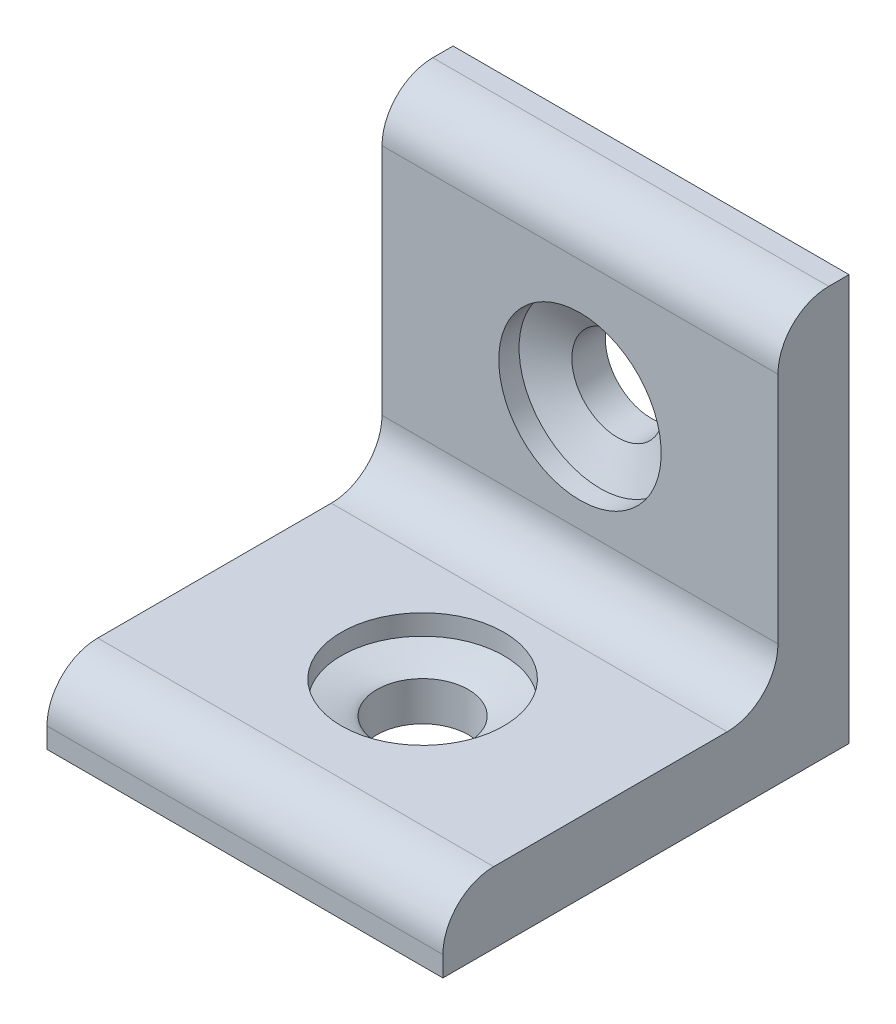
ISO-10303-21;
HEADER;
FILE_DESCRIPTION(('STEP AP214'),'2;1');
FILE_NAME('part.step','',(''),(''),'','','');
FILE_SCHEMA(('AUTOMOTIVE_DESIGN { 1 0 10303 214 1 1 1 1 }'));
ENDSEC;
DATA;
#1=APPLICATION_CONTEXT('core data for automotive mechanical design processes');
#2=APPLICATION_PROTOCOL_DEFINITION('international standard','automotive_design',2000,#1);
#3=PRODUCT_CONTEXT('',#1,'mechanical');
#4=PRODUCT('Part','Part','',(#3));
#5=PRODUCT_RELATED_PRODUCT_CATEGORY('part','',(#4));
#6=PRODUCT_DEFINITION_FORMATION('','',#4);
#7=PRODUCT_DEFINITION_CONTEXT('part definition',#1,'design');
#8=PRODUCT_DEFINITION('design','',#6,#7);
#9=PRODUCT_DEFINITION_SHAPE('','',#8);
#10=(LENGTH_UNIT() NAMED_UNIT(*) SI_UNIT(.MILLI.,.METRE.));
#11=(NAMED_UNIT(*) PLANE_ANGLE_UNIT() SI_UNIT($,.RADIAN.));
#12=(NAMED_UNIT(*) SI_UNIT($,.STERADIAN.) SOLID_ANGLE_UNIT());
#13=UNCERTAINTY_MEASURE_WITH_UNIT(LENGTH_MEASURE(1.E-05),#10,'distance_accuracy_value','');
#14=(GEOMETRIC_REPRESENTATION_CONTEXT(3) GLOBAL_UNCERTAINTY_ASSIGNED_CONTEXT((#13)) GLOBAL_UNIT_ASSIGNED_CONTEXT((#10,
#11,#12)) REPRESENTATION_CONTEXT('',''));
#15=CARTESIAN_POINT('',(0.,0.,0.));
#16=DIRECTION('',(0.,0.,1.));
#17=DIRECTION('',(1.,0.,0.));
#18=AXIS2_PLACEMENT_3D('',#15,#16,#17);
#19=CARTESIAN_POINT('',(19.5,22.5,40.001));
#20=DIRECTION('',(0.,0.,-1.));
#21=DIRECTION('',(0.,1.,0.));
#22=AXIS2_PLACEMENT_3D('',#19,#20,#21);
#23=CYLINDRICAL_SURFACE('',#22,4.5);
#24=CARTESIAN_POINT('',(19.5,22.5,3.3));
#25=DIRECTION('',(0.,0.,1.));
#26=DIRECTION('',(0.,-1.,0.));
#27=AXIS2_PLACEMENT_3D('',#24,#25,#26);
#28=CIRCLE('',#27,4.5);
#29=CARTESIAN_POINT('',(19.5,18.,3.3));
#30=VERTEX_POINT('',#29);
#31=EDGE_CURVE('E161',#30,#30,#28,.T.);
#32=ORIENTED_EDGE('',*,*,#31,.T.);
#33=EDGE_LOOP('',(#32));
#34=FACE_BOUND('',#33,.T.);
#35=CARTESIAN_POINT('',(19.5,22.5,0.));
#36=DIRECTION('',(0.,0.,1.));
#37=DIRECTION('',(0.,-1.,0.));
#38=AXIS2_PLACEMENT_3D('',#35,#36,#37);
#39=CIRCLE('',#38,4.5);
#40=CARTESIAN_POINT('',(19.5,18.,0.));
#41=VERTEX_POINT('',#40);
#42=EDGE_CURVE('E270',#41,#41,#39,.T.);
#43=ORIENTED_EDGE('',*,*,#42,.F.);
#44=EDGE_LOOP('',(#43));
#45=FACE_BOUND('',#44,.T.);
#46=ADVANCED_FACE('F16',(#34,#45),#23,.F.);
#47=CARTESIAN_POINT('',(19.5,40.001,22.5));
#48=DIRECTION('',(0.,-1.,0.));
#49=DIRECTION('',(0.,0.,-1.));
#50=AXIS2_PLACEMENT_3D('',#47,#48,#49);
#51=CYLINDRICAL_SURFACE('',#50,4.5);
#52=CARTESIAN_POINT('',(19.5,0.,22.5));
#53=DIRECTION('',(0.,-1.,0.));
#54=DIRECTION('',(0.,0.,-1.));
#55=AXIS2_PLACEMENT_3D('',#52,#53,#54);
#56=CIRCLE('',#55,4.5);
#57=CARTESIAN_POINT('',(19.5,0.,18.));
#58=VERTEX_POINT('',#57);
#59=EDGE_CURVE('E125',#58,#58,#56,.T.);
#60=ORIENTED_EDGE('',*,*,#59,.T.);
#61=EDGE_LOOP('',(#60));
#62=FACE_BOUND('',#61,.T.);
#63=CARTESIAN_POINT('',(19.5,3.86038641359816,22.5));
#64=DIRECTION('',(0.,1.,0.));
#65=DIRECTION('',(0.,0.,1.));
#66=AXIS2_PLACEMENT_3D('',#63,#64,#65);
#67=CIRCLE('',#66,4.50000000000001);
#68=CARTESIAN_POINT('',(19.3139036951039,3.86038641359816,18.0038496282593));
#69=VERTEX_POINT('',#68);
#70=EDGE_CURVE('E264',#69,#69,#67,.T.);
#71=ORIENTED_EDGE('',*,*,#70,.T.);
#72=EDGE_LOOP('',(#71));
#73=FACE_BOUND('',#72,.T.);
#74=ADVANCED_FACE('F177',(#62,#73),#51,.F.);
#75=CARTESIAN_POINT('',(39.,7.,0.));
#76=DIRECTION('',(0.,-1.,0.));
#77=DIRECTION('',(0.,0.,-1.));
#78=AXIS2_PLACEMENT_3D('',#75,#76,#77);
#79=PLANE('',#78);
#80=CARTESIAN_POINT('',(19.5,7.,22.5));
#81=DIRECTION('',(0.,1.,0.));
#82=DIRECTION('',(0.,0.,1.));
#83=AXIS2_PLACEMENT_3D('',#80,#81,#82);
#84=CIRCLE('',#83,8.);
#85=CARTESIAN_POINT('',(19.5,7.,30.5));
#86=VERTEX_POINT('',#85);
#87=EDGE_CURVE('E261',#86,#86,#84,.T.);
#88=ORIENTED_EDGE('',*,*,#87,.F.);
#89=EDGE_LOOP('',(#88));
#90=FACE_BOUND('',#89,.T.);
#91=DIRECTION('',(0.,0.,1.));
#92=VECTOR('',#91,1.);
#93=CARTESIAN_POINT('',(39.,7.,0.));
#94=LINE('',#93,#92);
#95=CARTESIAN_POINT('',(39.,7.,12.));
#96=VERTEX_POINT('',#95);
#97=CARTESIAN_POINT('',(39.,7.,35.));
#98=VERTEX_POINT('',#97);
#99=EDGE_CURVE('E110',#96,#98,#94,.T.);
#100=ORIENTED_EDGE('',*,*,#99,.F.);
#101=DIRECTION('',(-1.,0.,0.));
#102=VECTOR('',#101,1.);
#103=CARTESIAN_POINT('',(0.,7.,12.));
#104=LINE('',#103,#102);
#105=CARTESIAN_POINT('',(0.,7.,12.));
#106=VERTEX_POINT('',#105);
#107=EDGE_CURVE('E156',#96,#106,#104,.T.);
#108=ORIENTED_EDGE('',*,*,#107,.T.);
#109=DIRECTION('',(0.,0.,1.));
#110=VECTOR('',#109,1.);
#111=CARTESIAN_POINT('',(0.,7.,0.));
#112=LINE('',#111,#110);
#113=CARTESIAN_POINT('',(0.,7.,35.));
#114=VERTEX_POINT('',#113);
#115=EDGE_CURVE('E123',#106,#114,#112,.T.);
#116=ORIENTED_EDGE('',*,*,#115,.T.);
#117=DIRECTION('',(-1.,0.,0.));
#118=VECTOR('',#117,1.);
#119=CARTESIAN_POINT('',(39.,7.,35.));
#120=LINE('',#119,#118);
#121=EDGE_CURVE('E145',#114,#98,#120,.F.);
#122=ORIENTED_EDGE('',*,*,#121,.T.);
#123=EDGE_LOOP('',(#100,#108,#116,#122));
#124=FACE_BOUND('',#123,.T.);
#125=ADVANCED_FACE('F199',(#90,#124),#79,.F.);
#126=CARTESIAN_POINT('',(39.,0.,40.));
#127=DIRECTION('',(0.,0.,1.));
#128=DIRECTION('',(1.,0.,0.));
#129=AXIS2_PLACEMENT_3D('',#126,#127,#128);
#130=PLANE('',#129);
#131=DIRECTION('',(0.,1.,0.));
#132=VECTOR('',#131,1.);
#133=CARTESIAN_POINT('',(39.,0.,40.));
#134=LINE('',#133,#132);
#135=CARTESIAN_POINT('',(39.,0.,40.));
#136=VERTEX_POINT('',#135);
#137=CARTESIAN_POINT('',(39.,2.,40.));
#138=VERTEX_POINT('',#137);
#139=EDGE_CURVE('E91',#136,#138,#134,.T.);
#140=ORIENTED_EDGE('',*,*,#139,.T.);
#141=DIRECTION('',(-1.,0.,0.));
#142=VECTOR('',#141,1.);
#143=CARTESIAN_POINT('',(0.,2.,40.));
#144=LINE('',#143,#142);
#145=CARTESIAN_POINT('',(0.,2.,40.));
#146=VERTEX_POINT('',#145);
#147=EDGE_CURVE('E99',#138,#146,#144,.T.);
#148=ORIENTED_EDGE('',*,*,#147,.T.);
#149=DIRECTION('',(0.,1.,0.));
#150=VECTOR('',#149,1.);
#151=CARTESIAN_POINT('',(0.,0.,40.));
#152=LINE('',#151,#150);
#153=CARTESIAN_POINT('',(0.,0.,40.));
#154=VERTEX_POINT('',#153);
#155=EDGE_CURVE('E94',#154,#146,#152,.T.);
#156=ORIENTED_EDGE('',*,*,#155,.F.);
#157=DIRECTION('',(-1.,0.,0.));
#158=VECTOR('',#157,1.);
#159=CARTESIAN_POINT('',(39.,0.,40.));
#160=LINE('',#159,#158);
#161=EDGE_CURVE('E87',#136,#154,#160,.T.);
#162=ORIENTED_EDGE('',*,*,#161,.F.);
#163=EDGE_LOOP('',(#140,#148,#156,#162));
#164=FACE_BOUND('',#163,.T.);
#165=ADVANCED_FACE('F89',(#164),#130,.T.);
#166=CARTESIAN_POINT('',(39.,0.,0.));
#167=DIRECTION('',(0.,-1.,0.));
#168=DIRECTION('',(0.,0.,-1.));
#169=AXIS2_PLACEMENT_3D('',#166,#167,#168);
#170=PLANE('',#169);
#171=ORIENTED_EDGE('',*,*,#59,.F.);
#172=EDGE_LOOP('',(#171));
#173=FACE_BOUND('',#172,.T.);
#174=DIRECTION('',(0.,0.,1.));
#175=VECTOR('',#174,1.);
#176=CARTESIAN_POINT('',(0.,0.,0.));
#177=LINE('',#176,#175);
#178=CARTESIAN_POINT('',(0.,0.,0.));
#179=VERTEX_POINT('',#178);
#180=EDGE_CURVE('E127',#179,#154,#177,.T.);
#181=ORIENTED_EDGE('',*,*,#180,.F.);
#182=DIRECTION('',(-1.,0.,0.));
#183=VECTOR('',#182,1.);
#184=CARTESIAN_POINT('',(39.,0.,0.));
#185=LINE('',#184,#183);
#186=CARTESIAN_POINT('',(39.,0.,0.));
#187=VERTEX_POINT('',#186);
#188=EDGE_CURVE('E100',#187,#179,#185,.T.);
#189=ORIENTED_EDGE('',*,*,#188,.F.);
#190=DIRECTION('',(0.,0.,1.));
#191=VECTOR('',#190,1.);
#192=CARTESIAN_POINT('',(39.,0.,0.));
#193=LINE('',#192,#191);
#194=EDGE_CURVE('E106',#187,#136,#193,.T.);
#195=ORIENTED_EDGE('',*,*,#194,.T.);
#196=ORIENTED_EDGE('',*,*,#161,.T.);
#197=EDGE_LOOP('',(#181,#189,#195,#196));
#198=FACE_BOUND('',#197,.T.);
#199=ADVANCED_FACE('F112',(#173,#198),#170,.T.);
#200=CARTESIAN_POINT('',(39.,0.,0.));
#201=DIRECTION('',(0.,0.,-1.));
#202=DIRECTION('',(-1.,0.,0.));
#203=AXIS2_PLACEMENT_3D('',#200,#201,#202);
#204=PLANE('',#203);
#205=ORIENTED_EDGE('',*,*,#42,.T.);
#206=EDGE_LOOP('',(#205));
#207=FACE_BOUND('',#206,.T.);
#208=DIRECTION('',(0.,-1.,0.));
#209=VECTOR('',#208,1.);
#210=CARTESIAN_POINT('',(0.,0.,0.));
#211=LINE('',#210,#209);
#212=CARTESIAN_POINT('',(0.,40.,0.));
#213=VERTEX_POINT('',#212);
#214=EDGE_CURVE('E129',#213,#179,#211,.T.);
#215=ORIENTED_EDGE('',*,*,#214,.F.);
#216=DIRECTION('',(-1.,0.,0.));
#217=VECTOR('',#216,1.);
#218=CARTESIAN_POINT('',(39.,40.,0.));
#219=LINE('',#218,#217);
#220=CARTESIAN_POINT('',(39.,40.,0.));
#221=VERTEX_POINT('',#220);
#222=EDGE_CURVE('E122',#221,#213,#219,.T.);
#223=ORIENTED_EDGE('',*,*,#222,.F.);
#224=DIRECTION('',(0.,-1.,0.));
#225=VECTOR('',#224,1.);
#226=CARTESIAN_POINT('',(39.,0.,0.));
#227=LINE('',#226,#225);
#228=EDGE_CURVE('E113',#221,#187,#227,.T.);
#229=ORIENTED_EDGE('',*,*,#228,.T.);
#230=ORIENTED_EDGE('',*,*,#188,.T.);
#231=EDGE_LOOP('',(#215,#223,#229,#230));
#232=FACE_BOUND('',#231,.T.);
#233=ADVANCED_FACE('F214',(#207,#232),#204,.T.);
#234=CARTESIAN_POINT('',(39.,40.,7.));
#235=DIRECTION('',(0.,1.,0.));
#236=DIRECTION('',(0.,0.,1.));
#237=AXIS2_PLACEMENT_3D('',#234,#235,#236);
#238=PLANE('',#237);
#239=DIRECTION('',(0.,0.,-1.));
#240=VECTOR('',#239,1.);
#241=CARTESIAN_POINT('',(0.,40.,7.));
#242=LINE('',#241,#240);
#243=CARTESIAN_POINT('',(0.,40.,2.));
#244=VERTEX_POINT('',#243);
#245=EDGE_CURVE('E132',#244,#213,#242,.T.);
#246=ORIENTED_EDGE('',*,*,#245,.F.);
#247=DIRECTION('',(-1.,0.,0.));
#248=VECTOR('',#247,1.);
#249=CARTESIAN_POINT('',(39.,40.,2.));
#250=LINE('',#249,#248);
#251=CARTESIAN_POINT('',(39.,40.,2.));
#252=VERTEX_POINT('',#251);
#253=EDGE_CURVE('E154',#244,#252,#250,.F.);
#254=ORIENTED_EDGE('',*,*,#253,.T.);
#255=DIRECTION('',(0.,0.,-1.));
#256=VECTOR('',#255,1.);
#257=CARTESIAN_POINT('',(39.,40.,7.));
#258=LINE('',#257,#256);
#259=EDGE_CURVE('E115',#252,#221,#258,.T.);
#260=ORIENTED_EDGE('',*,*,#259,.T.);
#261=ORIENTED_EDGE('',*,*,#222,.T.);
#262=EDGE_LOOP('',(#246,#254,#260,#261));
#263=FACE_BOUND('',#262,.T.);
#264=ADVANCED_FACE('F210',(#263),#238,.T.);
#265=CARTESIAN_POINT('',(39.,0.,7.));
#266=DIRECTION('',(0.,0.,-1.));
#267=DIRECTION('',(-1.,0.,0.));
#268=AXIS2_PLACEMENT_3D('',#265,#266,#267);
#269=PLANE('',#268);
#270=CARTESIAN_POINT('',(19.5,22.5,7.));
#271=DIRECTION('',(0.,0.,-1.));
#272=DIRECTION('',(0.,1.,0.));
#273=AXIS2_PLACEMENT_3D('',#270,#271,#272);
#274=CIRCLE('',#273,8.);
#275=CARTESIAN_POINT('',(19.5,30.5,7.));
#276=VERTEX_POINT('',#275);
#277=EDGE_CURVE('E273',#276,#276,#274,.T.);
#278=ORIENTED_EDGE('',*,*,#277,.T.);
#279=EDGE_LOOP('',(#278));
#280=FACE_BOUND('',#279,.T.);
#281=DIRECTION('',(0.,1.,0.));
#282=VECTOR('',#281,1.);
#283=CARTESIAN_POINT('',(0.,0.,7.));
#284=LINE('',#283,#282);
#285=CARTESIAN_POINT('',(0.,35.,7.));
#286=VERTEX_POINT('',#285);
#287=CARTESIAN_POINT('',(0.,12.,7.));
#288=VERTEX_POINT('',#287);
#289=EDGE_CURVE('E134',#286,#288,#284,.F.);
#290=ORIENTED_EDGE('',*,*,#289,.T.);
#291=DIRECTION('',(-1.,0.,0.));
#292=VECTOR('',#291,1.);
#293=CARTESIAN_POINT('',(39.,12.,7.));
#294=LINE('',#293,#292);
#295=CARTESIAN_POINT('',(39.,12.,7.));
#296=VERTEX_POINT('',#295);
#297=EDGE_CURVE('E37',#288,#296,#294,.F.);
#298=ORIENTED_EDGE('',*,*,#297,.T.);
#299=DIRECTION('',(0.,1.,0.));
#300=VECTOR('',#299,1.);
#301=CARTESIAN_POINT('',(39.,0.,7.));
#302=LINE('',#301,#300);
#303=CARTESIAN_POINT('',(39.,35.,7.));
#304=VERTEX_POINT('',#303);
#305=EDGE_CURVE('E120',#304,#296,#302,.F.);
#306=ORIENTED_EDGE('',*,*,#305,.F.);
#307=DIRECTION('',(-1.,0.,0.));
#308=VECTOR('',#307,1.);
#309=CARTESIAN_POINT('',(0.,35.,7.));
#310=LINE('',#309,#308);
#311=EDGE_CURVE('E151',#304,#286,#310,.T.);
#312=ORIENTED_EDGE('',*,*,#311,.T.);
#313=EDGE_LOOP('',(#290,#298,#306,#312));
#314=FACE_BOUND('',#313,.T.);
#315=ADVANCED_FACE('F204',(#280,#314),#269,.F.);
#316=CARTESIAN_POINT('',(39.,0.,0.));
#317=DIRECTION('',(-1.,0.,0.));
#318=DIRECTION('',(0.,0.,1.));
#319=AXIS2_PLACEMENT_3D('',#316,#317,#318);
#320=PLANE('',#319);
#321=ORIENTED_EDGE('',*,*,#305,.T.);
#322=CARTESIAN_POINT('',(39.,12.,12.));
#323=DIRECTION('',(-1.,0.,0.));
#324=DIRECTION('',(0.,0.,1.));
#325=AXIS2_PLACEMENT_3D('',#322,#323,#324);
#326=CIRCLE('',#325,5.);
#327=EDGE_CURVE('E10',#296,#96,#326,.T.);
#328=ORIENTED_EDGE('',*,*,#327,.T.);
#329=ORIENTED_EDGE('',*,*,#99,.T.);
#330=CARTESIAN_POINT('',(39.,2.,35.));
#331=DIRECTION('',(-1.,0.,0.));
#332=DIRECTION('',(0.,0.,1.));
#333=AXIS2_PLACEMENT_3D('',#330,#331,#332);
#334=CIRCLE('',#333,5.);
#335=EDGE_CURVE('E109',#98,#138,#334,.F.);
#336=ORIENTED_EDGE('',*,*,#335,.T.);
#337=ORIENTED_EDGE('',*,*,#139,.F.);
#338=ORIENTED_EDGE('',*,*,#194,.F.);
#339=ORIENTED_EDGE('',*,*,#228,.F.);
#340=ORIENTED_EDGE('',*,*,#259,.F.);
#341=CARTESIAN_POINT('',(39.,35.,2.));
#342=DIRECTION('',(-1.,0.,0.));
#343=DIRECTION('',(0.,0.,1.));
#344=AXIS2_PLACEMENT_3D('',#341,#342,#343);
#345=CIRCLE('',#344,5.);
#346=EDGE_CURVE('E148',#252,#304,#345,.F.);
#347=ORIENTED_EDGE('',*,*,#346,.T.);
#348=EDGE_LOOP('',(#321,#328,#329,#336,#337,#338,#339,#340,#347));
#349=FACE_BOUND('',#348,.T.);
#350=ADVANCED_FACE('F104',(#349),#320,.F.);
#351=CARTESIAN_POINT('',(0.,0.,0.));
#352=DIRECTION('',(-1.,0.,0.));
#353=DIRECTION('',(0.,0.,1.));
#354=AXIS2_PLACEMENT_3D('',#351,#352,#353);
#355=PLANE('',#354);
#356=ORIENTED_EDGE('',*,*,#155,.T.);
#357=CARTESIAN_POINT('',(0.,2.,35.));
#358=DIRECTION('',(-1.,0.,0.));
#359=DIRECTION('',(0.,0.,1.));
#360=AXIS2_PLACEMENT_3D('',#357,#358,#359);
#361=CIRCLE('',#360,5.);
#362=EDGE_CURVE('E142',#146,#114,#361,.T.);
#363=ORIENTED_EDGE('',*,*,#362,.T.);
#364=ORIENTED_EDGE('',*,*,#115,.F.);
#365=CARTESIAN_POINT('',(0.,12.,12.));
#366=DIRECTION('',(-1.,0.,0.));
#367=DIRECTION('',(0.,0.,1.));
#368=AXIS2_PLACEMENT_3D('',#365,#366,#367);
#369=CIRCLE('',#368,5.);
#370=EDGE_CURVE('E24',#106,#288,#369,.F.);
#371=ORIENTED_EDGE('',*,*,#370,.T.);
#372=ORIENTED_EDGE('',*,*,#289,.F.);
#373=CARTESIAN_POINT('',(0.,35.,2.));
#374=DIRECTION('',(-1.,0.,0.));
#375=DIRECTION('',(0.,0.,1.));
#376=AXIS2_PLACEMENT_3D('',#373,#374,#375);
#377=CIRCLE('',#376,5.);
#378=EDGE_CURVE('E140',#286,#244,#377,.T.);
#379=ORIENTED_EDGE('',*,*,#378,.T.);
#380=ORIENTED_EDGE('',*,*,#245,.T.);
#381=ORIENTED_EDGE('',*,*,#214,.T.);
#382=ORIENTED_EDGE('',*,*,#180,.T.);
#383=EDGE_LOOP('',(#356,#363,#364,#371,#372,#379,#380,#381,#382));
#384=FACE_BOUND('',#383,.T.);
#385=ADVANCED_FACE('F203',(#384),#355,.T.);
#386=CARTESIAN_POINT('',(39.,2.,35.));
#387=DIRECTION('',(1.,0.,0.));
#388=DIRECTION('',(0.,0.,-1.));
#389=AXIS2_PLACEMENT_3D('',#386,#387,#388);
#390=CYLINDRICAL_SURFACE('',#389,5.);
#391=ORIENTED_EDGE('',*,*,#335,.F.);
#392=ORIENTED_EDGE('',*,*,#121,.F.);
#393=ORIENTED_EDGE('',*,*,#362,.F.);
#394=ORIENTED_EDGE('',*,*,#147,.F.);
#395=EDGE_LOOP('',(#391,#392,#393,#394));
#396=FACE_BOUND('',#395,.T.);
#397=ADVANCED_FACE('F207',(#396),#390,.T.);
#398=CARTESIAN_POINT('',(39.,35.,2.));
#399=DIRECTION('',(1.,0.,0.));
#400=DIRECTION('',(0.,0.,-1.));
#401=AXIS2_PLACEMENT_3D('',#398,#399,#400);
#402=CYLINDRICAL_SURFACE('',#401,5.);
#403=ORIENTED_EDGE('',*,*,#346,.F.);
#404=ORIENTED_EDGE('',*,*,#253,.F.);
#405=ORIENTED_EDGE('',*,*,#378,.F.);
#406=ORIENTED_EDGE('',*,*,#311,.F.);
#407=EDGE_LOOP('',(#403,#404,#405,#406));
#408=FACE_BOUND('',#407,.T.);
#409=ADVANCED_FACE('F195',(#408),#402,.T.);
#410=CARTESIAN_POINT('',(19.5,5.,22.5));
#411=DIRECTION('',(0.,1.,0.));
#412=DIRECTION('',(0.,0.,1.));
#413=AXIS2_PLACEMENT_3D('',#410,#411,#412);
#414=CYLINDRICAL_SURFACE('',#413,8.);
#415=CARTESIAN_POINT('',(19.5,5.,22.5));
#416=DIRECTION('',(0.,1.,0.));
#417=DIRECTION('',(0.,0.,1.));
#418=AXIS2_PLACEMENT_3D('',#415,#416,#417);
#419=CIRCLE('',#418,8.00000000000001);
#420=CARTESIAN_POINT('',(24.4162725405535,5.,16.1888777299913));
#421=VERTEX_POINT('',#420);
#422=EDGE_CURVE('E267',#421,#421,#419,.T.);
#423=ORIENTED_EDGE('',*,*,#422,.F.);
#424=EDGE_LOOP('',(#423));
#425=FACE_BOUND('',#424,.T.);
#426=ORIENTED_EDGE('',*,*,#87,.T.);
#427=EDGE_LOOP('',(#426));
#428=FACE_BOUND('',#427,.T.);
#429=ADVANCED_FACE('F186',(#425,#428),#414,.F.);
#430=CARTESIAN_POINT('',(16.8048969473128,3.3,18.8963324882286));
#431=CARTESIAN_POINT('',(24.4162725405535,5.,16.1888777299913));
#432=CARTESIAN_POINT('',(9.59756192377012,3.3,24.286538593603));
#433=CARTESIAN_POINT('',(11.7940280005362,5.,6.35633264888426));
#434=CARTESIAN_POINT('',(14.9877680291444,3.3,31.4938736171457));
#435=CARTESIAN_POINT('',(1.96148291942911,5.,18.9785771889016));
#436=CARTESIAN_POINT('',(22.1951030526872,3.3,26.1036675117714));
#437=CARTESIAN_POINT('',(14.5837274594465,5.,28.8111222700087));
#438=CARTESIAN_POINT('',(29.4024380762299,3.3,20.713461406397));
#439=CARTESIAN_POINT('',(27.2059719994638,5.,38.6436673511157));
#440=CARTESIAN_POINT('',(24.0122319708556,3.3,13.5061263828543));
#441=CARTESIAN_POINT('',(37.0385170805709,5.,26.0214228110984));
#442=CARTESIAN_POINT('',(16.8048969473128,3.3,18.8963324882286));
#443=CARTESIAN_POINT('',(24.4162725405535,5.,16.1888777299913));
#444=(BOUNDED_SURFACE() B_SPLINE_SURFACE(3,1,((#430,#431),(#432,#433),(#434,#435),(#436,#437),
(#438,#439),(#440,#441),(#442,#443)),.UNSPECIFIED.,.T.,.F.,.F.) B_SPLINE_SURFACE_WITH_KNOTS((4,
3,4),(2,2),(0.,0.5,1.),(0.,1.),
.UNSPECIFIED.) GEOMETRIC_REPRESENTATION_ITEM() RATIONAL_B_SPLINE_SURFACE(((1.,1.),
(0.333333333333333,0.333333333333333),(0.333333333333333,0.333333333333333),(1.,1.),
(0.333333333333333,0.333333333333333),(0.333333333333333,0.333333333333333),(1.,1.))) REPRESENTATION_ITEM('') SURFACE());
#445=CARTESIAN_POINT('',(24.4162725405535,5.,16.1888777299913));
#446=CARTESIAN_POINT('',(24.3631228650801,4.98812902514165,16.2077836872649));
#447=CARTESIAN_POINT('',(24.3099731896067,4.97625805028329,16.2266896445386));
#448=CARTESIAN_POINT('',(24.2036738386598,4.95251610056659,16.2645015590858));
#449=CARTESIAN_POINT('',(24.1505241631864,4.94064512570824,16.2834075163594));
#450=CARTESIAN_POINT('',(24.0442248122395,4.91690317599153,16.3212194309067));
#451=CARTESIAN_POINT('',(23.991075136766,4.90503220113318,16.3401253881803));
#452=CARTESIAN_POINT('',(23.8847757858192,4.88129025141647,16.3779373027276));
#453=CARTESIAN_POINT('',(23.8316261103457,4.86941927655812,16.3968432600012));
#454=CARTESIAN_POINT('',(23.7253267593989,4.84567732684142,16.4346551745484));
#455=CARTESIAN_POINT('',(23.6721770839254,4.83380635198306,16.4535611318221));
#456=CARTESIAN_POINT('',(23.5658777329786,4.81006440226636,16.4913730463693));
#457=CARTESIAN_POINT('',(23.5127280575051,4.79819342740801,16.5102790036429));
#458=CARTESIAN_POINT('',(23.4064287065583,4.7744514776913,16.5480909181902));
#459=CARTESIAN_POINT('',(23.3532790310848,4.76258050283295,16.5669968754638));
#460=CARTESIAN_POINT('',(23.246979680138,4.73883855311624,16.6048087900111));
#461=CARTESIAN_POINT('',(23.1938300046645,4.72696757825789,16.6237147472847));
#462=CARTESIAN_POINT('',(23.0875306537177,4.70322562854119,16.6615266618319));
#463=CARTESIAN_POINT('',(23.0343809782442,4.69135465368284,16.6804326191056));
#464=CARTESIAN_POINT('',(22.9280816272974,4.66761270396613,16.7182445336528));
#465=CARTESIAN_POINT('',(22.8749319518239,4.65574172910778,16.7371504909264));
#466=CARTESIAN_POINT('',(22.7686326008771,4.63199977939107,16.7749624054737));
#467=CARTESIAN_POINT('',(22.7154829254036,4.62012880453272,16.7938683627473));
#468=CARTESIAN_POINT('',(22.6091835744568,4.59638685481601,16.8316802772946));
#469=CARTESIAN_POINT('',(22.5560338989833,4.58451587995766,16.8505862345682));
#470=CARTESIAN_POINT('',(22.4497345480365,4.56077393024096,16.8883981491154));
#471=CARTESIAN_POINT('',(22.396584872563,4.5489029553826,16.9073041063891));
#472=CARTESIAN_POINT('',(22.2902855216162,4.5251610056659,16.9451160209363));
#473=CARTESIAN_POINT('',(22.2371358461427,4.51329003080755,16.9640219782099));
#474=CARTESIAN_POINT('',(22.1308364951959,4.48954808109084,17.0018338927572));
#475=CARTESIAN_POINT('',(22.0776868197224,4.47767710623249,17.0207398500308));
#476=CARTESIAN_POINT('',(21.9713874687756,4.45393515651578,17.0585517645781));
#477=CARTESIAN_POINT('',(21.9182377933021,4.44206418165743,17.0774577218517));
#478=CARTESIAN_POINT('',(21.8119384423553,4.41832223194073,17.1152696363989));
#479=CARTESIAN_POINT('',(21.7587887668818,4.40645125708237,17.1341755936726));
#480=CARTESIAN_POINT('',(21.652489415935,4.38270930736567,17.1719875082198));
#481=CARTESIAN_POINT('',(21.5993397404615,4.37083833250732,17.1908934654934));
#482=CARTESIAN_POINT('',(21.4930403895147,4.34709638279061,17.2287053800407));
#483=CARTESIAN_POINT('',(21.4398907140412,4.33522540793226,17.2476113373143));
#484=CARTESIAN_POINT('',(21.3335913630944,4.31148345821556,17.2854232518616));
#485=CARTESIAN_POINT('',(21.2804416876209,4.2996124833572,17.3043292091352));
#486=CARTESIAN_POINT('',(21.174142336674,4.2758705336405,17.3421411236824));
#487=CARTESIAN_POINT('',(21.1209926612006,4.26399955878215,17.361047080956));
#488=CARTESIAN_POINT('',(21.0146933102537,4.24025760906544,17.3988589955033));
#489=CARTESIAN_POINT('',(20.9615436347803,4.22838663420709,17.4177649527769));
#490=CARTESIAN_POINT('',(20.8552442838334,4.20464468449038,17.4555768673242));
#491=CARTESIAN_POINT('',(20.80209460836,4.19277370963203,17.4744828245978));
#492=CARTESIAN_POINT('',(20.6957952574131,4.16903175991532,17.512294739145));
#493=CARTESIAN_POINT('',(20.6426455819397,4.15716078505697,17.5312006964187));
#494=CARTESIAN_POINT('',(20.5363462309928,4.13341883534027,17.5690126109659));
#495=CARTESIAN_POINT('',(20.4831965555194,4.12154786048192,17.5879185682395));
#496=CARTESIAN_POINT('',(20.3768972045725,4.09780591076521,17.6257304827868));
#497=CARTESIAN_POINT('',(20.3237475290991,4.08593493590686,17.6446364400604));
#498=CARTESIAN_POINT('',(20.2174481781522,4.06219298619015,17.6824483546077));
#499=CARTESIAN_POINT('',(20.1642985026788,4.0503220113318,17.7013543118813));
#500=CARTESIAN_POINT('',(20.0579991517319,4.0265800616151,17.7391662264285));
#501=CARTESIAN_POINT('',(20.0048494762585,4.01470908675674,17.7580721837022));
#502=CARTESIAN_POINT('',(19.8985501253116,3.99096713704004,17.7958840982494));
#503=CARTESIAN_POINT('',(19.8454004498382,3.97909616218169,17.814790055523));
#504=CARTESIAN_POINT('',(19.7391010988913,3.95535421246498,17.8526019700703));
#505=CARTESIAN_POINT('',(19.6859514234179,3.94348323760663,17.8715079273439));
#506=CARTESIAN_POINT('',(19.579652072471,3.91974128788992,17.9093198418912));
#507=CARTESIAN_POINT('',(19.5265023969976,3.90787031303157,17.9282257991648));
#508=CARTESIAN_POINT('',(19.4202030460507,3.88412836331487,17.966037713712));
#509=CARTESIAN_POINT('',(19.3670533705773,3.87225738845651,17.9849436709857));
#510=CARTESIAN_POINT('',(19.3139036951039,3.86038641359816,18.0038496282593));
#511=B_SPLINE_CURVE_WITH_KNOTS('',3,(#445,#446,#447,#448,#449,#450,#451,#452,#453,#454,#455,
#456,#457,#458,#459,#460,#461,#462,#463,#464,#465,#466,#467,#468,#469,#470,#471,#472,#473,#474,
#475,#476,#477,#478,#479,#480,#481,#482,#483,#484,#485,#486,#487,#488,#489,#490,#491,#492,#493,
#494,#495,#496,#497,#498,#499,#500,#501,#502,#503,#504,#505,#506,#507,#508,#509,#510),
.UNSPECIFIED.,.F.,.F.,(4,2,2,2,2,2,2,2,2,2,2,2,2,2,2,2,2,2,2,2,2,2,2,2,2,2,2,2,2,2,2,2,4),(0.,
0.172942734473178,0.345885468946356,0.518828203419533,0.691770937892709,0.864713672365886,
1.03765640683907,1.21059914131224,1.38354187578542,1.5564846102586,1.72942734473177,
1.90237007920495,2.07531281367813,2.24825554815131,2.42119828262448,2.59414101709766,
2.76708375157084,2.94002648604402,3.11296922051719,3.28591195499037,3.45885468946355,
3.63179742393673,3.8047401584099,3.97768289288308,4.15062562735626,4.32356836182944,
4.49651109630261,4.66945383077579,4.84239656524897,5.01533929972215,5.18828203419532,
5.3612247686685,5.53416750314168),.UNSPECIFIED.);
#512=EDGE_CURVE('',#421,#69,#511,.T.);
#513=ORIENTED_EDGE('',*,*,#422,.T.);
#514=ORIENTED_EDGE('',*,*,#70,.F.);
#515=ORIENTED_EDGE('',*,*,#512,.T.);
#516=ORIENTED_EDGE('',*,*,#512,.F.);
#517=EDGE_LOOP('',(#513,#515,#514,#516));
#518=FACE_BOUND('',#517,.T.);
#519=ADVANCED_FACE('F181',(#518),#444,.F.);
#520=CARTESIAN_POINT('',(19.5,22.5,5.));
#521=DIRECTION('',(0.,0.,1.));
#522=DIRECTION('',(0.,-1.,0.));
#523=AXIS2_PLACEMENT_3D('',#520,#521,#522);
#524=CYLINDRICAL_SURFACE('',#523,8.);
#525=CARTESIAN_POINT('',(19.5,22.5,5.));
#526=DIRECTION('',(0.,0.,-1.));
#527=DIRECTION('',(0.,1.,0.));
#528=AXIS2_PLACEMENT_3D('',#525,#526,#527);
#529=CIRCLE('',#528,8.);
#530=CARTESIAN_POINT('',(19.5,30.5,5.));
#531=VERTEX_POINT('',#530);
#532=EDGE_CURVE('E276',#531,#531,#529,.T.);
#533=ORIENTED_EDGE('',*,*,#532,.T.);
#534=EDGE_LOOP('',(#533));
#535=FACE_BOUND('',#534,.T.);
#536=ORIENTED_EDGE('',*,*,#277,.F.);
#537=EDGE_LOOP('',(#536));
#538=FACE_BOUND('',#537,.T.);
#539=ADVANCED_FACE('F178',(#535,#538),#524,.F.);
#540=CARTESIAN_POINT('',(19.5,22.5,3.3));
#541=DIRECTION('',(0.,0.,1.));
#542=DIRECTION('',(0.,1.,0.));
#543=AXIS2_PLACEMENT_3D('',#540,#541,#542);
#544=CONICAL_SURFACE('',#543,4.5,1.11864246450912);
#545=ORIENTED_EDGE('',*,*,#31,.F.);
#546=EDGE_LOOP('',(#545));
#547=FACE_BOUND('',#546,.T.);
#548=ORIENTED_EDGE('',*,*,#532,.F.);
#549=EDGE_LOOP('',(#548));
#550=FACE_BOUND('',#549,.T.);
#551=ADVANCED_FACE('F282',(#547,#550),#544,.F.);
#552=CARTESIAN_POINT('',(39.,12.,12.));
#553=DIRECTION('',(1.,0.,0.));
#554=DIRECTION('',(0.,0.,-1.));
#555=AXIS2_PLACEMENT_3D('',#552,#553,#554);
#556=CYLINDRICAL_SURFACE('',#555,5.);
#557=ORIENTED_EDGE('',*,*,#327,.F.);
#558=ORIENTED_EDGE('',*,*,#297,.F.);
#559=ORIENTED_EDGE('',*,*,#370,.F.);
#560=ORIENTED_EDGE('',*,*,#107,.F.);
#561=EDGE_LOOP('',(#557,#558,#559,#560));
#562=FACE_BOUND('',#561,.T.);
#563=ADVANCED_FACE('F18',(#562),#556,.F.);
#564=CLOSED_SHELL('',(#46,#74,#125,#165,#199,#233,#264,#315,#350,#385,#397,#409,#429,#519,#539,
#551,#563));
#565=MANIFOLD_SOLID_BREP('B1',#564);
#566=ADVANCED_BREP_SHAPE_REPRESENTATION('',(#18,#565),#14);
#567=SHAPE_DEFINITION_REPRESENTATION(#9,#566);
ENDSEC;
END-ISO-10303-21;
